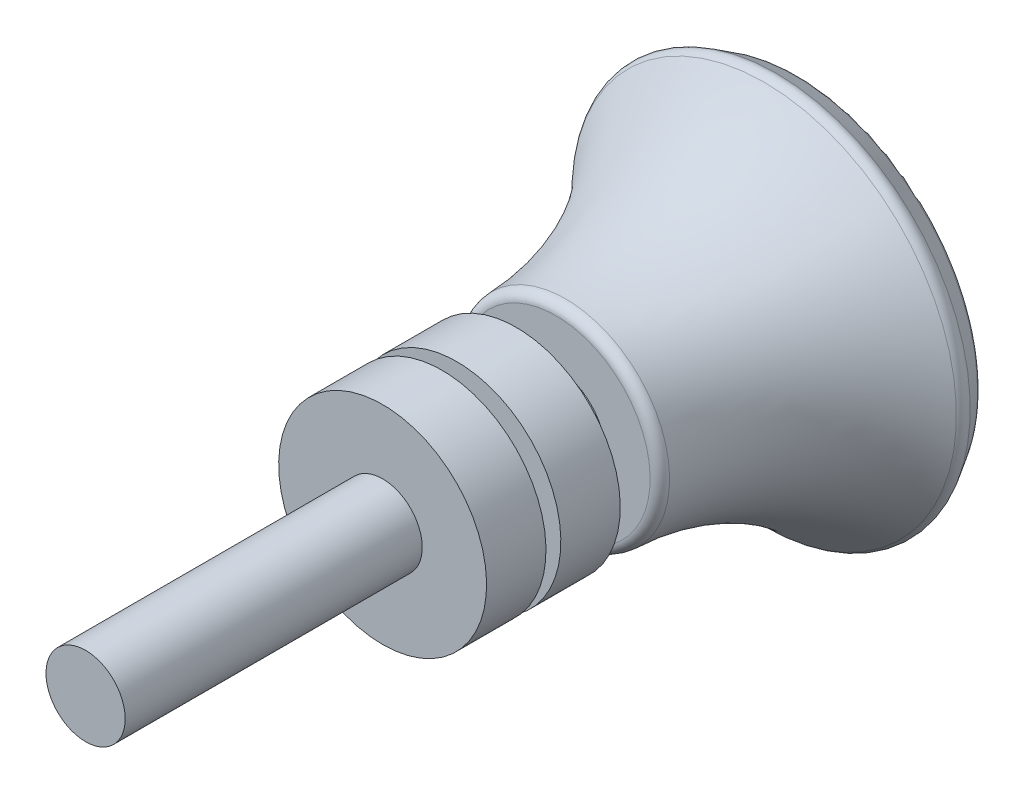
ISO-10303-21;
HEADER;
FILE_DESCRIPTION(('STEP AP214'),'2;1');
FILE_NAME('part.step','',(''),(''),'','','');
FILE_SCHEMA(('AUTOMOTIVE_DESIGN { 1 0 10303 214 1 1 1 1 }'));
ENDSEC;
DATA;
#1=APPLICATION_CONTEXT('core data for automotive mechanical design processes');
#2=APPLICATION_PROTOCOL_DEFINITION('international standard','automotive_design',2000,#1);
#3=PRODUCT_CONTEXT('',#1,'mechanical');
#4=PRODUCT('Part','Part','',(#3));
#5=PRODUCT_RELATED_PRODUCT_CATEGORY('part','',(#4));
#6=PRODUCT_DEFINITION_FORMATION('','',#4);
#7=PRODUCT_DEFINITION_CONTEXT('part definition',#1,'design');
#8=PRODUCT_DEFINITION('design','',#6,#7);
#9=PRODUCT_DEFINITION_SHAPE('','',#8);
#10=(LENGTH_UNIT() NAMED_UNIT(*) SI_UNIT(.MILLI.,.METRE.));
#11=(NAMED_UNIT(*) PLANE_ANGLE_UNIT() SI_UNIT($,.RADIAN.));
#12=(NAMED_UNIT(*) SI_UNIT($,.STERADIAN.) SOLID_ANGLE_UNIT());
#13=UNCERTAINTY_MEASURE_WITH_UNIT(LENGTH_MEASURE(1.E-05),#10,'distance_accuracy_value','');
#14=(GEOMETRIC_REPRESENTATION_CONTEXT(3) GLOBAL_UNCERTAINTY_ASSIGNED_CONTEXT((#13)) GLOBAL_UNIT_ASSIGNED_CONTEXT((#10,
#11,#12)) REPRESENTATION_CONTEXT('',''));
#15=CARTESIAN_POINT('',(0.,0.,0.));
#16=DIRECTION('',(0.,0.,1.));
#17=DIRECTION('',(1.,0.,0.));
#18=AXIS2_PLACEMENT_3D('',#15,#16,#17);
#19=CARTESIAN_POINT('',(0.,0.,-64.6487626680429));
#20=DIRECTION('',(0.,0.,1.));
#21=DIRECTION('',(0.,-1.,0.));
#22=AXIS2_PLACEMENT_3D('',#19,#20,#21);
#23=SPHERICAL_SURFACE('',#22,34.648762668043);
#24=CARTESIAN_POINT('',(0.,0.,-34.5087024827375));
#25=DIRECTION('',(0.,0.,1.));
#26=DIRECTION('',(0.,-1.,0.));
#27=AXIS2_PLACEMENT_3D('',#24,#25,#26);
#28=CIRCLE('',#27,17.0913289843866);
#29=CARTESIAN_POINT('',(0.,-17.0913289843866,-34.5087024827375));
#30=VERTEX_POINT('',#29);
#31=EDGE_CURVE('E10',#30,#30,#28,.T.);
#32=ORIENTED_EDGE('',*,*,#31,.F.);
#33=EDGE_LOOP('',(#32));
#34=FACE_BOUND('',#33,.T.);
#35=ADVANCED_FACE('F33',(#34),#23,.F.);
#36=CARTESIAN_POINT('',(0.,0.,-33.6388284132342));
#37=DIRECTION('',(0.,0.,1.));
#38=DIRECTION('',(0.,-1.,0.));
#39=AXIS2_PLACEMENT_3D('',#36,#37,#38);
#40=TOROIDAL_SURFACE('',#39,17.5846028466637,0.999999999999992);
#41=CARTESIAN_POINT('',(0.,0.,-34.1563094040691));
#42=DIRECTION('',(0.,0.,1.));
#43=DIRECTION('',(0.,-1.,0.));
#44=AXIS2_PLACEMENT_3D('',#41,#42,#43);
#45=CIRCLE('',#44,18.4402975493028);
#46=CARTESIAN_POINT('',(0.,-18.4402975493028,-34.1563094040691));
#47=VERTEX_POINT('',#46);
#48=EDGE_CURVE('E40',#47,#47,#45,.T.);
#49=ORIENTED_EDGE('',*,*,#48,.F.);
#50=EDGE_LOOP('',(#49));
#51=FACE_BOUND('',#50,.T.);
#52=ORIENTED_EDGE('',*,*,#31,.T.);
#53=EDGE_LOOP('',(#52));
#54=FACE_BOUND('',#53,.T.);
#55=ADVANCED_FACE('F187',(#51,#54),#40,.T.);
#56=CARTESIAN_POINT('',(0.,0.,-34.1563094040691));
#57=DIRECTION('',(0.,0.,1.));
#58=DIRECTION('',(0.,-1.,0.));
#59=AXIS2_PLACEMENT_3D('',#56,#57,#58);
#60=CONICAL_SURFACE('',#59,18.4402975493028,0.543904503706936);
#61=CARTESIAN_POINT('',(0.,0.,-32.2689653334884));
#62=DIRECTION('',(0.,0.,1.));
#63=DIRECTION('',(0.,-1.,0.));
#64=AXIS2_PLACEMENT_3D('',#61,#62,#63);
#65=CIRCLE('',#64,19.5816680365551);
#66=CARTESIAN_POINT('',(0.,-19.5816680365551,-32.2689653334884));
#67=VERTEX_POINT('',#66);
#68=EDGE_CURVE('E45',#67,#67,#65,.T.);
#69=ORIENTED_EDGE('',*,*,#68,.F.);
#70=EDGE_LOOP('',(#69));
#71=FACE_BOUND('',#70,.T.);
#72=ORIENTED_EDGE('',*,*,#48,.T.);
#73=EDGE_LOOP('',(#72));
#74=FACE_BOUND('',#73,.T.);
#75=ADVANCED_FACE('F182',(#71,#74),#60,.T.);
#76=CARTESIAN_POINT('',(0.,0.,-31.7514843426535));
#77=DIRECTION('',(0.,0.,1.));
#78=DIRECTION('',(0.,-1.,0.));
#79=AXIS2_PLACEMENT_3D('',#76,#77,#78);
#80=TOROIDAL_SURFACE('',#79,18.725973333916,1.);
#81=CARTESIAN_POINT('',(0.,0.,-31.0325226715792));
#82=DIRECTION('',(0.,0.,1.));
#83=DIRECTION('',(0.,-1.,0.));
#84=AXIS2_PLACEMENT_3D('',#81,#82,#83);
#85=CIRCLE('',#84,19.4210230555374);
#86=CARTESIAN_POINT('',(0.,-19.4210230555374,-31.0325226715792));
#87=VERTEX_POINT('',#86);
#88=EDGE_CURVE('E50',#87,#87,#85,.T.);
#89=ORIENTED_EDGE('',*,*,#88,.F.);
#90=EDGE_LOOP('',(#89));
#91=FACE_BOUND('',#90,.T.);
#92=ORIENTED_EDGE('',*,*,#68,.T.);
#93=EDGE_LOOP('',(#92));
#94=FACE_BOUND('',#93,.T.);
#95=ADVANCED_FACE('F176',(#91,#94),#80,.T.);
#96=CARTESIAN_POINT('',(0.,0.,-9.99999999999999));
#97=DIRECTION('',(0.,0.,1.));
#98=DIRECTION('',(0.,-1.,0.));
#99=AXIS2_PLACEMENT_3D('',#96,#97,#98);
#100=TOROIDAL_SURFACE('',#99,39.7540249609568,29.2540249609567);
#101=CARTESIAN_POINT('',(0.,0.,-10.9669465467391));
#102=DIRECTION('',(0.,0.,1.));
#103=DIRECTION('',(0.,-1.,0.));
#104=AXIS2_PLACEMENT_3D('',#101,#102,#103);
#105=CIRCLE('',#104,10.5159848284166);
#106=CARTESIAN_POINT('',(0.,-10.5159848284166,-10.9669465467391));
#107=VERTEX_POINT('',#106);
#108=EDGE_CURVE('E56',#107,#107,#105,.T.);
#109=ORIENTED_EDGE('',*,*,#108,.F.);
#110=EDGE_LOOP('',(#109));
#111=FACE_BOUND('',#110,.T.);
#112=ORIENTED_EDGE('',*,*,#88,.T.);
#113=EDGE_LOOP('',(#112));
#114=FACE_BOUND('',#113,.T.);
#115=ADVANCED_FACE('F170',(#111,#114),#100,.F.);
#116=CARTESIAN_POINT('',(0.,0.,-11.));
#117=DIRECTION('',(0.,0.,1.));
#118=DIRECTION('',(0.,-1.,0.));
#119=AXIS2_PLACEMENT_3D('',#116,#117,#118);
#120=TOROIDAL_SURFACE('',#119,9.51653124308731,1.);
#121=CARTESIAN_POINT('',(0.,0.,-10.));
#122=DIRECTION('',(0.,0.,1.));
#123=DIRECTION('',(0.,-1.,0.));
#124=AXIS2_PLACEMENT_3D('',#121,#122,#123);
#125=CIRCLE('',#124,9.51653124308731);
#126=CARTESIAN_POINT('',(0.,-9.51653124308732,-10.));
#127=VERTEX_POINT('',#126);
#128=EDGE_CURVE('E60',#127,#127,#125,.T.);
#129=ORIENTED_EDGE('',*,*,#128,.F.);
#130=EDGE_LOOP('',(#129));
#131=FACE_BOUND('',#130,.T.);
#132=ORIENTED_EDGE('',*,*,#108,.T.);
#133=EDGE_LOOP('',(#132));
#134=FACE_BOUND('',#133,.T.);
#135=ADVANCED_FACE('F164',(#131,#134),#120,.T.);
#136=CARTESIAN_POINT('',(0.,5.,-10.));
#137=DIRECTION('',(0.,0.,-1.));
#138=DIRECTION('',(0.,1.,0.));
#139=AXIS2_PLACEMENT_3D('',#136,#137,#138);
#140=PLANE('',#139);
#141=CARTESIAN_POINT('',(0.,0.,-10.));
#142=DIRECTION('',(0.,0.,1.));
#143=DIRECTION('',(0.,-1.,0.));
#144=AXIS2_PLACEMENT_3D('',#141,#142,#143);
#145=CIRCLE('',#144,5.00000000000001);
#146=CARTESIAN_POINT('',(0.,-5.00000000000001,-10.));
#147=VERTEX_POINT('',#146);
#148=EDGE_CURVE('E64',#147,#147,#145,.T.);
#149=ORIENTED_EDGE('',*,*,#148,.F.);
#150=EDGE_LOOP('',(#149));
#151=FACE_BOUND('',#150,.T.);
#152=ORIENTED_EDGE('',*,*,#128,.T.);
#153=EDGE_LOOP('',(#152));
#154=FACE_BOUND('',#153,.T.);
#155=ADVANCED_FACE('F158',(#151,#154),#140,.F.);
#156=CARTESIAN_POINT('',(0.,0.,37.5));
#157=DIRECTION('',(0.,0.,1.));
#158=DIRECTION('',(0.,-1.,0.));
#159=AXIS2_PLACEMENT_3D('',#156,#157,#158);
#160=CYLINDRICAL_SURFACE('',#159,5.);
#161=CARTESIAN_POINT('',(0.,0.,-6.));
#162=DIRECTION('',(0.,0.,1.));
#163=DIRECTION('',(0.,-1.,0.));
#164=AXIS2_PLACEMENT_3D('',#161,#162,#163);
#165=CIRCLE('',#164,5.);
#166=CARTESIAN_POINT('',(0.,-5.00000000000001,-6.));
#167=VERTEX_POINT('',#166);
#168=EDGE_CURVE('E68',#167,#167,#165,.T.);
#169=ORIENTED_EDGE('',*,*,#168,.F.);
#170=EDGE_LOOP('',(#169));
#171=FACE_BOUND('',#170,.T.);
#172=ORIENTED_EDGE('',*,*,#148,.T.);
#173=EDGE_LOOP('',(#172));
#174=FACE_BOUND('',#173,.T.);
#175=ADVANCED_FACE('F152',(#171,#174),#160,.T.);
#176=CARTESIAN_POINT('',(0.,10.5,-6.));
#177=DIRECTION('',(0.,0.,1.));
#178=DIRECTION('',(0.,-1.,0.));
#179=AXIS2_PLACEMENT_3D('',#176,#177,#178);
#180=PLANE('',#179);
#181=CARTESIAN_POINT('',(0.,0.,-6.));
#182=DIRECTION('',(0.,0.,1.));
#183=DIRECTION('',(0.,-1.,0.));
#184=AXIS2_PLACEMENT_3D('',#181,#182,#183);
#185=CIRCLE('',#184,10.5);
#186=CARTESIAN_POINT('',(0.,-10.5,-6.));
#187=VERTEX_POINT('',#186);
#188=EDGE_CURVE('E72',#187,#187,#185,.T.);
#189=ORIENTED_EDGE('',*,*,#188,.F.);
#190=EDGE_LOOP('',(#189));
#191=FACE_BOUND('',#190,.T.);
#192=ORIENTED_EDGE('',*,*,#168,.T.);
#193=EDGE_LOOP('',(#192));
#194=FACE_BOUND('',#193,.T.);
#195=ADVANCED_FACE('F146',(#191,#194),#180,.F.);
#196=CARTESIAN_POINT('',(0.,0.,37.5));
#197=DIRECTION('',(0.,0.,1.));
#198=DIRECTION('',(0.,-1.,0.));
#199=AXIS2_PLACEMENT_3D('',#196,#197,#198);
#200=CYLINDRICAL_SURFACE('',#199,10.5);
#201=CARTESIAN_POINT('',(0.,0.,0.));
#202=DIRECTION('',(0.,0.,1.));
#203=DIRECTION('',(0.,-1.,0.));
#204=AXIS2_PLACEMENT_3D('',#201,#202,#203);
#205=CIRCLE('',#204,10.5);
#206=CARTESIAN_POINT('',(0.,-10.5,0.));
#207=VERTEX_POINT('',#206);
#208=EDGE_CURVE('E76',#207,#207,#205,.T.);
#209=ORIENTED_EDGE('',*,*,#208,.F.);
#210=EDGE_LOOP('',(#209));
#211=FACE_BOUND('',#210,.T.);
#212=ORIENTED_EDGE('',*,*,#188,.T.);
#213=EDGE_LOOP('',(#212));
#214=FACE_BOUND('',#213,.T.);
#215=ADVANCED_FACE('F140',(#211,#214),#200,.T.);
#216=CARTESIAN_POINT('',(0.,5.,0.));
#217=DIRECTION('',(0.,0.,-1.));
#218=DIRECTION('',(0.,1.,0.));
#219=AXIS2_PLACEMENT_3D('',#216,#217,#218);
#220=PLANE('',#219);
#221=CARTESIAN_POINT('',(0.,0.,0.));
#222=DIRECTION('',(0.,0.,1.));
#223=DIRECTION('',(0.,-1.,0.));
#224=AXIS2_PLACEMENT_3D('',#221,#222,#223);
#225=CIRCLE('',#224,5.);
#226=CARTESIAN_POINT('',(0.,-5.00000000000001,0.));
#227=VERTEX_POINT('',#226);
#228=EDGE_CURVE('E80',#227,#227,#225,.T.);
#229=ORIENTED_EDGE('',*,*,#228,.F.);
#230=EDGE_LOOP('',(#229));
#231=FACE_BOUND('',#230,.T.);
#232=ORIENTED_EDGE('',*,*,#208,.T.);
#233=EDGE_LOOP('',(#232));
#234=FACE_BOUND('',#233,.T.);
#235=ADVANCED_FACE('F134',(#231,#234),#220,.F.);
#236=CARTESIAN_POINT('',(0.,0.,37.5));
#237=DIRECTION('',(0.,0.,1.));
#238=DIRECTION('',(0.,-1.,0.));
#239=AXIS2_PLACEMENT_3D('',#236,#237,#238);
#240=CYLINDRICAL_SURFACE('',#239,5.);
#241=CARTESIAN_POINT('',(0.,0.,1.5));
#242=DIRECTION('',(0.,0.,1.));
#243=DIRECTION('',(0.,-1.,0.));
#244=AXIS2_PLACEMENT_3D('',#241,#242,#243);
#245=CIRCLE('',#244,5.);
#246=CARTESIAN_POINT('',(0.,-5.00000000000001,1.5));
#247=VERTEX_POINT('',#246);
#248=EDGE_CURVE('E84',#247,#247,#245,.T.);
#249=ORIENTED_EDGE('',*,*,#248,.F.);
#250=EDGE_LOOP('',(#249));
#251=FACE_BOUND('',#250,.T.);
#252=ORIENTED_EDGE('',*,*,#228,.T.);
#253=EDGE_LOOP('',(#252));
#254=FACE_BOUND('',#253,.T.);
#255=ADVANCED_FACE('F128',(#251,#254),#240,.T.);
#256=CARTESIAN_POINT('',(0.,10.5,1.5));
#257=DIRECTION('',(0.,0.,1.));
#258=DIRECTION('',(0.,-1.,0.));
#259=AXIS2_PLACEMENT_3D('',#256,#257,#258);
#260=PLANE('',#259);
#261=CARTESIAN_POINT('',(0.,0.,1.5));
#262=DIRECTION('',(0.,0.,1.));
#263=DIRECTION('',(0.,-1.,0.));
#264=AXIS2_PLACEMENT_3D('',#261,#262,#263);
#265=CIRCLE('',#264,10.5);
#266=CARTESIAN_POINT('',(0.,-10.5,1.5));
#267=VERTEX_POINT('',#266);
#268=EDGE_CURVE('E88',#267,#267,#265,.T.);
#269=ORIENTED_EDGE('',*,*,#268,.F.);
#270=EDGE_LOOP('',(#269));
#271=FACE_BOUND('',#270,.T.);
#272=ORIENTED_EDGE('',*,*,#248,.T.);
#273=EDGE_LOOP('',(#272));
#274=FACE_BOUND('',#273,.T.);
#275=ADVANCED_FACE('F122',(#271,#274),#260,.F.);
#276=CARTESIAN_POINT('',(0.,0.,37.5));
#277=DIRECTION('',(0.,0.,1.));
#278=DIRECTION('',(0.,-1.,0.));
#279=AXIS2_PLACEMENT_3D('',#276,#277,#278);
#280=CYLINDRICAL_SURFACE('',#279,10.5);
#281=CARTESIAN_POINT('',(0.,0.,7.5));
#282=DIRECTION('',(0.,0.,1.));
#283=DIRECTION('',(0.,-1.,0.));
#284=AXIS2_PLACEMENT_3D('',#281,#282,#283);
#285=CIRCLE('',#284,10.5);
#286=CARTESIAN_POINT('',(0.,-10.5,7.5));
#287=VERTEX_POINT('',#286);
#288=EDGE_CURVE('E92',#287,#287,#285,.T.);
#289=ORIENTED_EDGE('',*,*,#288,.F.);
#290=EDGE_LOOP('',(#289));
#291=FACE_BOUND('',#290,.T.);
#292=ORIENTED_EDGE('',*,*,#268,.T.);
#293=EDGE_LOOP('',(#292));
#294=FACE_BOUND('',#293,.T.);
#295=ADVANCED_FACE('F116',(#291,#294),#280,.T.);
#296=CARTESIAN_POINT('',(0.,4.,7.5));
#297=DIRECTION('',(0.,0.,-1.));
#298=DIRECTION('',(0.,1.,0.));
#299=AXIS2_PLACEMENT_3D('',#296,#297,#298);
#300=PLANE('',#299);
#301=CARTESIAN_POINT('',(0.,0.,7.5));
#302=DIRECTION('',(0.,0.,1.));
#303=DIRECTION('',(0.,-1.,0.));
#304=AXIS2_PLACEMENT_3D('',#301,#302,#303);
#305=CIRCLE('',#304,4.);
#306=CARTESIAN_POINT('',(0.,-4.00000000000001,7.5));
#307=VERTEX_POINT('',#306);
#308=EDGE_CURVE('E96',#307,#307,#305,.T.);
#309=ORIENTED_EDGE('',*,*,#308,.F.);
#310=EDGE_LOOP('',(#309));
#311=FACE_BOUND('',#310,.T.);
#312=ORIENTED_EDGE('',*,*,#288,.T.);
#313=EDGE_LOOP('',(#312));
#314=FACE_BOUND('',#313,.T.);
#315=ADVANCED_FACE('F110',(#311,#314),#300,.F.);
#316=CARTESIAN_POINT('',(0.,0.,37.5));
#317=DIRECTION('',(0.,0.,1.));
#318=DIRECTION('',(0.,-1.,0.));
#319=AXIS2_PLACEMENT_3D('',#316,#317,#318);
#320=CYLINDRICAL_SURFACE('',#319,4.);
#321=CARTESIAN_POINT('',(0.,0.,37.5));
#322=DIRECTION('',(0.,0.,1.));
#323=DIRECTION('',(0.,-1.,0.));
#324=AXIS2_PLACEMENT_3D('',#321,#322,#323);
#325=CIRCLE('',#324,4.);
#326=CARTESIAN_POINT('',(0.,-4.,37.5));
#327=VERTEX_POINT('',#326);
#328=EDGE_CURVE('E100',#327,#327,#325,.T.);
#329=ORIENTED_EDGE('',*,*,#328,.F.);
#330=EDGE_LOOP('',(#329));
#331=FACE_BOUND('',#330,.T.);
#332=ORIENTED_EDGE('',*,*,#308,.T.);
#333=EDGE_LOOP('',(#332));
#334=FACE_BOUND('',#333,.T.);
#335=ADVANCED_FACE('F107',(#331,#334),#320,.T.);
#336=CARTESIAN_POINT('',(0.,0.,37.5));
#337=DIRECTION('',(0.,0.,-1.));
#338=DIRECTION('',(0.,1.,0.));
#339=AXIS2_PLACEMENT_3D('',#336,#337,#338);
#340=PLANE('',#339);
#341=ORIENTED_EDGE('',*,*,#328,.T.);
#342=EDGE_LOOP('',(#341));
#343=FACE_BOUND('',#342,.T.);
#344=ADVANCED_FACE('F105',(#343),#340,.F.);
#345=CLOSED_SHELL('',(#35,#55,#75,#95,#115,#135,#155,#175,#195,#215,#235,#255,#275,#295,#315,
#335,#344));
#346=MANIFOLD_SOLID_BREP('B2',#345);
#347=ADVANCED_BREP_SHAPE_REPRESENTATION('',(#18,#346),#14);
#348=SHAPE_DEFINITION_REPRESENTATION(#9,#347);
ENDSEC;
END-ISO-10303-21;
